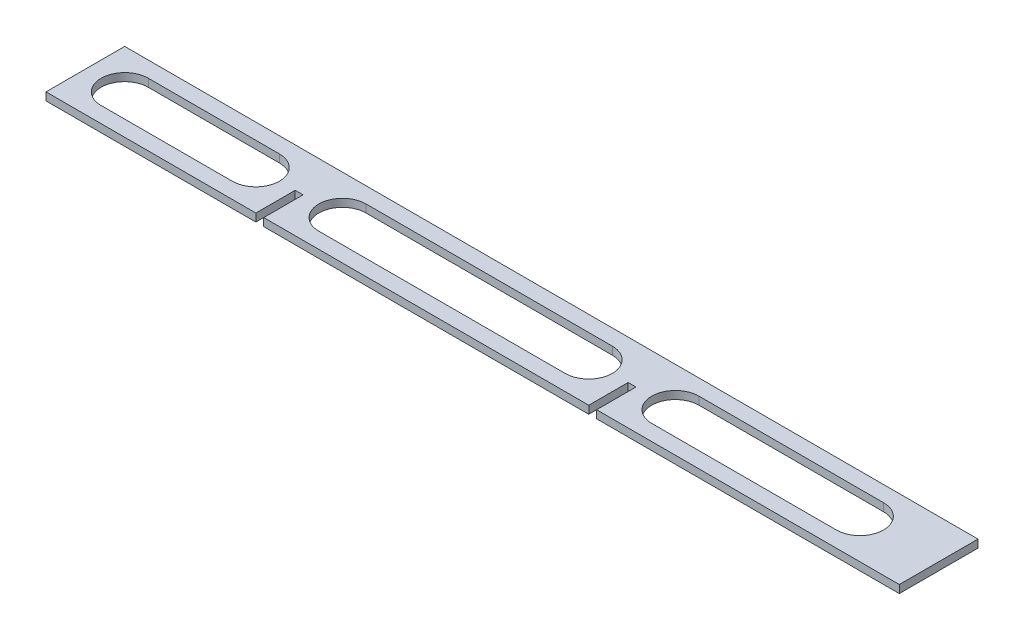
ISO-10303-21;
HEADER;
FILE_DESCRIPTION(('STEP AP214'),'2;1');
FILE_NAME('part.step','',(''),(''),'','','');
FILE_SCHEMA(('AUTOMOTIVE_DESIGN { 1 0 10303 214 1 1 1 1 }'));
ENDSEC;
DATA;
#1=APPLICATION_CONTEXT('core data for automotive mechanical design processes');
#2=APPLICATION_PROTOCOL_DEFINITION('international standard','automotive_design',2000,#1);
#3=PRODUCT_CONTEXT('',#1,'mechanical');
#4=PRODUCT('Part','Part','',(#3));
#5=PRODUCT_RELATED_PRODUCT_CATEGORY('part','',(#4));
#6=PRODUCT_DEFINITION_FORMATION('','',#4);
#7=PRODUCT_DEFINITION_CONTEXT('part definition',#1,'design');
#8=PRODUCT_DEFINITION('design','',#6,#7);
#9=PRODUCT_DEFINITION_SHAPE('','',#8);
#10=(LENGTH_UNIT() NAMED_UNIT(*) SI_UNIT(.MILLI.,.METRE.));
#11=(NAMED_UNIT(*) PLANE_ANGLE_UNIT() SI_UNIT($,.RADIAN.));
#12=(NAMED_UNIT(*) SI_UNIT($,.STERADIAN.) SOLID_ANGLE_UNIT());
#13=UNCERTAINTY_MEASURE_WITH_UNIT(LENGTH_MEASURE(1.E-05),#10,'distance_accuracy_value','');
#14=(GEOMETRIC_REPRESENTATION_CONTEXT(3) GLOBAL_UNCERTAINTY_ASSIGNED_CONTEXT((#13)) GLOBAL_UNIT_ASSIGNED_CONTEXT((#10,
#11,#12)) REPRESENTATION_CONTEXT('',''));
#15=CARTESIAN_POINT('',(0.,0.,0.));
#16=DIRECTION('',(0.,0.,1.));
#17=DIRECTION('',(1.,0.,0.));
#18=AXIS2_PLACEMENT_3D('',#15,#16,#17);
#19=CARTESIAN_POINT('',(0.,3.,15.));
#20=DIRECTION('',(0.,0.,-1.));
#21=DIRECTION('',(-1.,0.,0.));
#22=AXIS2_PLACEMENT_3D('',#19,#20,#21);
#23=PLANE('',#22);
#24=DIRECTION('',(1.,0.,0.));
#25=VECTOR('',#24,1.);
#26=CARTESIAN_POINT('',(0.,0.,15.));
#27=LINE('',#26,#25);
#28=CARTESIAN_POINT('',(0.,0.,15.));
#29=VERTEX_POINT('',#28);
#30=CARTESIAN_POINT('',(80.,0.,15.));
#31=VERTEX_POINT('',#30);
#32=EDGE_CURVE('E373',#29,#31,#27,.T.);
#33=ORIENTED_EDGE('',*,*,#32,.T.);
#34=DIRECTION('',(0.,1.,0.));
#35=VECTOR('',#34,1.);
#36=CARTESIAN_POINT('',(80.,0.,15.));
#37=LINE('',#36,#35);
#38=CARTESIAN_POINT('',(80.,3.,15.));
#39=VERTEX_POINT('',#38);
#40=EDGE_CURVE('E314',#31,#39,#37,.T.);
#41=ORIENTED_EDGE('',*,*,#40,.T.);
#42=DIRECTION('',(1.,0.,0.));
#43=VECTOR('',#42,1.);
#44=CARTESIAN_POINT('',(0.,3.,15.));
#45=LINE('',#44,#43);
#46=CARTESIAN_POINT('',(0.,3.,15.));
#47=VERTEX_POINT('',#46);
#48=EDGE_CURVE('E361',#47,#39,#45,.T.);
#49=ORIENTED_EDGE('',*,*,#48,.F.);
#50=DIRECTION('',(0.,-1.,0.));
#51=VECTOR('',#50,1.);
#52=CARTESIAN_POINT('',(0.,3.,15.));
#53=LINE('',#52,#51);
#54=EDGE_CURVE('E11',#47,#29,#53,.T.);
#55=ORIENTED_EDGE('',*,*,#54,.T.);
#56=EDGE_LOOP('',(#33,#41,#49,#55));
#57=FACE_BOUND('',#56,.T.);
#58=ADVANCED_FACE('F41',(#57),#23,.F.);
#59=CARTESIAN_POINT('',(83.,3.,15.));
#60=VERTEX_POINT('',#59);
#61=CARTESIAN_POINT('',(206.9,3.,15.));
#62=VERTEX_POINT('',#61);
#63=EDGE_CURVE('E365',#60,#62,#45,.T.);
#64=ORIENTED_EDGE('',*,*,#63,.F.);
#65=DIRECTION('',(0.,1.,0.));
#66=VECTOR('',#65,1.);
#67=CARTESIAN_POINT('',(83.,0.,15.));
#68=LINE('',#67,#66);
#69=CARTESIAN_POINT('',(83.,0.,15.));
#70=VERTEX_POINT('',#69);
#71=EDGE_CURVE('E328',#70,#60,#68,.T.);
#72=ORIENTED_EDGE('',*,*,#71,.F.);
#73=CARTESIAN_POINT('',(206.9,0.,15.));
#74=VERTEX_POINT('',#73);
#75=EDGE_CURVE('E377',#70,#74,#27,.T.);
#76=ORIENTED_EDGE('',*,*,#75,.T.);
#77=DIRECTION('',(0.,1.,0.));
#78=VECTOR('',#77,1.);
#79=CARTESIAN_POINT('',(206.9,0.,15.));
#80=LINE('',#79,#78);
#81=EDGE_CURVE('E332',#74,#62,#80,.T.);
#82=ORIENTED_EDGE('',*,*,#81,.T.);
#83=EDGE_LOOP('',(#64,#72,#76,#82));
#84=FACE_BOUND('',#83,.T.);
#85=ADVANCED_FACE('F417',(#84),#23,.F.);
#86=CARTESIAN_POINT('',(0.,3.,-15.));
#87=DIRECTION('',(1.,0.,0.));
#88=DIRECTION('',(0.,0.,-1.));
#89=AXIS2_PLACEMENT_3D('',#86,#87,#88);
#90=PLANE('',#89);
#91=DIRECTION('',(0.,0.,1.));
#92=VECTOR('',#91,1.);
#93=CARTESIAN_POINT('',(0.,0.,-15.));
#94=LINE('',#93,#92);
#95=CARTESIAN_POINT('',(0.,0.,-15.));
#96=VERTEX_POINT('',#95);
#97=EDGE_CURVE('E325',#96,#29,#94,.T.);
#98=ORIENTED_EDGE('',*,*,#97,.T.);
#99=ORIENTED_EDGE('',*,*,#54,.F.);
#100=DIRECTION('',(0.,0.,1.));
#101=VECTOR('',#100,1.);
#102=CARTESIAN_POINT('',(0.,3.,-15.));
#103=LINE('',#102,#101);
#104=CARTESIAN_POINT('',(0.,3.,-15.));
#105=VERTEX_POINT('',#104);
#106=EDGE_CURVE('E356',#105,#47,#103,.T.);
#107=ORIENTED_EDGE('',*,*,#106,.F.);
#108=DIRECTION('',(0.,-1.,0.));
#109=VECTOR('',#108,1.);
#110=CARTESIAN_POINT('',(0.,3.,-15.));
#111=LINE('',#110,#109);
#112=EDGE_CURVE('E369',#105,#96,#111,.T.);
#113=ORIENTED_EDGE('',*,*,#112,.T.);
#114=EDGE_LOOP('',(#98,#99,#107,#113));
#115=FACE_BOUND('',#114,.T.);
#116=ADVANCED_FACE('F43',(#115),#90,.F.);
#117=CARTESIAN_POINT('',(209.9,3.,15.));
#118=VERTEX_POINT('',#117);
#119=CARTESIAN_POINT('',(325.28,3.,15.));
#120=VERTEX_POINT('',#119);
#121=EDGE_CURVE('E359',#118,#120,#45,.T.);
#122=ORIENTED_EDGE('',*,*,#121,.F.);
#123=DIRECTION('',(0.,1.,0.));
#124=VECTOR('',#123,1.);
#125=CARTESIAN_POINT('',(209.9,0.,15.));
#126=LINE('',#125,#124);
#127=CARTESIAN_POINT('',(209.9,0.,15.));
#128=VERTEX_POINT('',#127);
#129=EDGE_CURVE('E336',#128,#118,#126,.T.);
#130=ORIENTED_EDGE('',*,*,#129,.F.);
#131=CARTESIAN_POINT('',(325.28,0.,15.));
#132=VERTEX_POINT('',#131);
#133=EDGE_CURVE('E372',#128,#132,#27,.T.);
#134=ORIENTED_EDGE('',*,*,#133,.T.);
#135=DIRECTION('',(0.,-1.,0.));
#136=VECTOR('',#135,1.);
#137=CARTESIAN_POINT('',(325.28,3.,15.));
#138=LINE('',#137,#136);
#139=EDGE_CURVE('E49',#120,#132,#138,.T.);
#140=ORIENTED_EDGE('',*,*,#139,.F.);
#141=EDGE_LOOP('',(#122,#130,#134,#140));
#142=FACE_BOUND('',#141,.T.);
#143=ADVANCED_FACE('F428',(#142),#23,.F.);
#144=CARTESIAN_POINT('',(325.28,3.,-15.));
#145=DIRECTION('',(-1.,0.,0.));
#146=DIRECTION('',(0.,0.,1.));
#147=AXIS2_PLACEMENT_3D('',#144,#145,#146);
#148=PLANE('',#147);
#149=DIRECTION('',(0.,0.,-1.));
#150=VECTOR('',#149,1.);
#151=CARTESIAN_POINT('',(325.28,0.,-15.));
#152=LINE('',#151,#150);
#153=CARTESIAN_POINT('',(325.28,0.,-15.));
#154=VERTEX_POINT('',#153);
#155=EDGE_CURVE('E376',#132,#154,#152,.T.);
#156=ORIENTED_EDGE('',*,*,#155,.T.);
#157=DIRECTION('',(0.,-1.,0.));
#158=VECTOR('',#157,1.);
#159=CARTESIAN_POINT('',(325.28,3.,-15.));
#160=LINE('',#159,#158);
#161=CARTESIAN_POINT('',(325.28,3.,-15.));
#162=VERTEX_POINT('',#161);
#163=EDGE_CURVE('E382',#162,#154,#160,.T.);
#164=ORIENTED_EDGE('',*,*,#163,.F.);
#165=DIRECTION('',(0.,0.,-1.));
#166=VECTOR('',#165,1.);
#167=CARTESIAN_POINT('',(325.28,3.,-15.));
#168=LINE('',#167,#166);
#169=EDGE_CURVE('E364',#120,#162,#168,.T.);
#170=ORIENTED_EDGE('',*,*,#169,.F.);
#171=ORIENTED_EDGE('',*,*,#139,.T.);
#172=EDGE_LOOP('',(#156,#164,#170,#171));
#173=FACE_BOUND('',#172,.T.);
#174=ADVANCED_FACE('F389',(#173),#148,.F.);
#175=CARTESIAN_POINT('',(0.,3.,-15.));
#176=DIRECTION('',(0.,0.,1.));
#177=DIRECTION('',(1.,0.,0.));
#178=AXIS2_PLACEMENT_3D('',#175,#176,#177);
#179=PLANE('',#178);
#180=DIRECTION('',(-1.,0.,0.));
#181=VECTOR('',#180,1.);
#182=CARTESIAN_POINT('',(0.,0.,-15.));
#183=LINE('',#182,#181);
#184=EDGE_CURVE('E360',#154,#96,#183,.T.);
#185=ORIENTED_EDGE('',*,*,#184,.T.);
#186=ORIENTED_EDGE('',*,*,#112,.F.);
#187=DIRECTION('',(-1.,0.,0.));
#188=VECTOR('',#187,1.);
#189=CARTESIAN_POINT('',(0.,3.,-15.));
#190=LINE('',#189,#188);
#191=EDGE_CURVE('E367',#162,#105,#190,.T.);
#192=ORIENTED_EDGE('',*,*,#191,.F.);
#193=ORIENTED_EDGE('',*,*,#163,.T.);
#194=EDGE_LOOP('',(#185,#186,#192,#193));
#195=FACE_BOUND('',#194,.T.);
#196=ADVANCED_FACE('F399',(#195),#179,.F.);
#197=CARTESIAN_POINT('',(0.,3.,0.));
#198=DIRECTION('',(0.,1.,0.));
#199=DIRECTION('',(0.,0.,1.));
#200=AXIS2_PLACEMENT_3D('',#197,#198,#199);
#201=PLANE('',#200);
#202=CARTESIAN_POINT('',(15.,3.,0.));
#203=DIRECTION('',(0.,1.,0.));
#204=DIRECTION('',(0.,0.,1.));
#205=AXIS2_PLACEMENT_3D('',#202,#203,#204);
#206=CIRCLE('',#205,9.);
#207=CARTESIAN_POINT('',(15.,3.,-9.));
#208=VERTEX_POINT('',#207);
#209=CARTESIAN_POINT('',(15.,3.,9.));
#210=VERTEX_POINT('',#209);
#211=EDGE_CURVE('E56',#208,#210,#206,.T.);
#212=ORIENTED_EDGE('',*,*,#211,.F.);
#213=DIRECTION('',(-1.,0.,0.));
#214=VECTOR('',#213,1.);
#215=CARTESIAN_POINT('',(15.,3.,-9.));
#216=LINE('',#215,#214);
#217=CARTESIAN_POINT('',(65.,3.,-9.));
#218=VERTEX_POINT('',#217);
#219=EDGE_CURVE('E223',#218,#208,#216,.T.);
#220=ORIENTED_EDGE('',*,*,#219,.F.);
#221=CARTESIAN_POINT('',(65.,3.,0.));
#222=DIRECTION('',(0.,1.,0.));
#223=DIRECTION('',(0.,0.,1.));
#224=AXIS2_PLACEMENT_3D('',#221,#222,#223);
#225=CIRCLE('',#224,9.);
#226=CARTESIAN_POINT('',(65.,3.,9.));
#227=VERTEX_POINT('',#226);
#228=EDGE_CURVE('E226',#227,#218,#225,.T.);
#229=ORIENTED_EDGE('',*,*,#228,.F.);
#230=DIRECTION('',(1.,0.,0.));
#231=VECTOR('',#230,1.);
#232=CARTESIAN_POINT('',(15.,3.,9.));
#233=LINE('',#232,#231);
#234=EDGE_CURVE('E232',#210,#227,#233,.T.);
#235=ORIENTED_EDGE('',*,*,#234,.F.);
#236=EDGE_LOOP('',(#212,#220,#229,#235));
#237=FACE_BOUND('',#236,.T.);
#238=CARTESIAN_POINT('',(98.,3.,0.));
#239=DIRECTION('',(0.,1.,0.));
#240=DIRECTION('',(0.,0.,1.));
#241=AXIS2_PLACEMENT_3D('',#238,#239,#240);
#242=CIRCLE('',#241,9.00000000000001);
#243=CARTESIAN_POINT('',(98.,3.,-9.));
#244=VERTEX_POINT('',#243);
#245=CARTESIAN_POINT('',(98.,3.,9.00000000000003));
#246=VERTEX_POINT('',#245);
#247=EDGE_CURVE('E64',#244,#246,#242,.T.);
#248=ORIENTED_EDGE('',*,*,#247,.F.);
#249=DIRECTION('',(-1.,0.,0.));
#250=VECTOR('',#249,1.);
#251=CARTESIAN_POINT('',(98.,3.,-9.));
#252=LINE('',#251,#250);
#253=CARTESIAN_POINT('',(191.9,3.,-9.));
#254=VERTEX_POINT('',#253);
#255=EDGE_CURVE('E252',#254,#244,#252,.T.);
#256=ORIENTED_EDGE('',*,*,#255,.F.);
#257=CARTESIAN_POINT('',(191.9,3.,0.));
#258=DIRECTION('',(0.,1.,0.));
#259=DIRECTION('',(0.,0.,1.));
#260=AXIS2_PLACEMENT_3D('',#257,#258,#259);
#261=CIRCLE('',#260,9.00000000000001);
#262=CARTESIAN_POINT('',(191.9,3.,9.00000000000001));
#263=VERTEX_POINT('',#262);
#264=EDGE_CURVE('E255',#263,#254,#261,.T.);
#265=ORIENTED_EDGE('',*,*,#264,.F.);
#266=DIRECTION('',(1.,0.,0.));
#267=VECTOR('',#266,1.);
#268=CARTESIAN_POINT('',(98.,3.,9.00000000000003));
#269=LINE('',#268,#267);
#270=EDGE_CURVE('E259',#246,#263,#269,.T.);
#271=ORIENTED_EDGE('',*,*,#270,.F.);
#272=EDGE_LOOP('',(#248,#256,#265,#271));
#273=FACE_BOUND('',#272,.T.);
#274=CARTESIAN_POINT('',(224.9,3.,0.));
#275=DIRECTION('',(0.,1.,0.));
#276=DIRECTION('',(0.,0.,1.));
#277=AXIS2_PLACEMENT_3D('',#274,#275,#276);
#278=CIRCLE('',#277,9.00000000000001);
#279=CARTESIAN_POINT('',(224.9,3.,-9.));
#280=VERTEX_POINT('',#279);
#281=CARTESIAN_POINT('',(224.9,3.,9.00000000000002));
#282=VERTEX_POINT('',#281);
#283=EDGE_CURVE('E251',#280,#282,#278,.T.);
#284=ORIENTED_EDGE('',*,*,#283,.F.);
#285=DIRECTION('',(-1.,0.,0.));
#286=VECTOR('',#285,1.);
#287=CARTESIAN_POINT('',(224.9,3.,-9.));
#288=LINE('',#287,#286);
#289=CARTESIAN_POINT('',(295.28,3.,-9.));
#290=VERTEX_POINT('',#289);
#291=EDGE_CURVE('E283',#290,#280,#288,.T.);
#292=ORIENTED_EDGE('',*,*,#291,.F.);
#293=CARTESIAN_POINT('',(295.28,3.,0.));
#294=DIRECTION('',(0.,1.,0.));
#295=DIRECTION('',(0.,0.,1.));
#296=AXIS2_PLACEMENT_3D('',#293,#294,#295);
#297=CIRCLE('',#296,9.00000000000001);
#298=CARTESIAN_POINT('',(295.28,3.,9.00000000000002));
#299=VERTEX_POINT('',#298);
#300=EDGE_CURVE('E286',#299,#290,#297,.T.);
#301=ORIENTED_EDGE('',*,*,#300,.F.);
#302=DIRECTION('',(1.,0.,0.));
#303=VECTOR('',#302,1.);
#304=CARTESIAN_POINT('',(224.9,3.,9.00000000000002));
#305=LINE('',#304,#303);
#306=EDGE_CURVE('E290',#282,#299,#305,.T.);
#307=ORIENTED_EDGE('',*,*,#306,.F.);
#308=EDGE_LOOP('',(#284,#292,#301,#307));
#309=FACE_BOUND('',#308,.T.);
#310=DIRECTION('',(0.,0.,1.));
#311=VECTOR('',#310,1.);
#312=CARTESIAN_POINT('',(80.,3.,15.));
#313=LINE('',#312,#311);
#314=CARTESIAN_POINT('',(80.,3.,0.));
#315=VERTEX_POINT('',#314);
#316=EDGE_CURVE('E315',#315,#39,#313,.T.);
#317=ORIENTED_EDGE('',*,*,#316,.F.);
#318=DIRECTION('',(-1.,0.,0.));
#319=VECTOR('',#318,1.);
#320=CARTESIAN_POINT('',(80.,3.,0.));
#321=LINE('',#320,#319);
#322=CARTESIAN_POINT('',(83.,3.,0.));
#323=VERTEX_POINT('',#322);
#324=EDGE_CURVE('E308',#323,#315,#321,.T.);
#325=ORIENTED_EDGE('',*,*,#324,.F.);
#326=DIRECTION('',(0.,0.,-1.));
#327=VECTOR('',#326,1.);
#328=CARTESIAN_POINT('',(83.,3.,15.));
#329=LINE('',#328,#327);
#330=EDGE_CURVE('E317',#60,#323,#329,.T.);
#331=ORIENTED_EDGE('',*,*,#330,.F.);
#332=ORIENTED_EDGE('',*,*,#63,.T.);
#333=DIRECTION('',(0.,0.,1.));
#334=VECTOR('',#333,1.);
#335=CARTESIAN_POINT('',(206.9,3.,15.));
#336=LINE('',#335,#334);
#337=CARTESIAN_POINT('',(206.9,3.,0.));
#338=VERTEX_POINT('',#337);
#339=EDGE_CURVE('E318',#338,#62,#336,.T.);
#340=ORIENTED_EDGE('',*,*,#339,.F.);
#341=DIRECTION('',(-1.,0.,0.));
#342=VECTOR('',#341,1.);
#343=CARTESIAN_POINT('',(206.9,3.,0.));
#344=LINE('',#343,#342);
#345=CARTESIAN_POINT('',(209.9,3.,0.));
#346=VERTEX_POINT('',#345);
#347=EDGE_CURVE('E341',#346,#338,#344,.T.);
#348=ORIENTED_EDGE('',*,*,#347,.F.);
#349=DIRECTION('',(0.,0.,-1.));
#350=VECTOR('',#349,1.);
#351=CARTESIAN_POINT('',(209.9,3.,15.));
#352=LINE('',#351,#350);
#353=EDGE_CURVE('E344',#118,#346,#352,.T.);
#354=ORIENTED_EDGE('',*,*,#353,.F.);
#355=ORIENTED_EDGE('',*,*,#121,.T.);
#356=ORIENTED_EDGE('',*,*,#169,.T.);
#357=ORIENTED_EDGE('',*,*,#191,.T.);
#358=ORIENTED_EDGE('',*,*,#106,.T.);
#359=ORIENTED_EDGE('',*,*,#48,.T.);
#360=EDGE_LOOP('',(#317,#325,#331,#332,#340,#348,#354,#355,#356,#357,#358,#359));
#361=FACE_BOUND('',#360,.T.);
#362=ADVANCED_FACE('F406',(#237,#273,#309,#361),#201,.T.);
#363=CARTESIAN_POINT('',(0.,0.,0.));
#364=DIRECTION('',(0.,1.,0.));
#365=DIRECTION('',(0.,0.,1.));
#366=AXIS2_PLACEMENT_3D('',#363,#364,#365);
#367=PLANE('',#366);
#368=DIRECTION('',(-1.,0.,0.));
#369=VECTOR('',#368,1.);
#370=CARTESIAN_POINT('',(15.,0.,-9.));
#371=LINE('',#370,#369);
#372=CARTESIAN_POINT('',(65.,0.,-9.));
#373=VERTEX_POINT('',#372);
#374=CARTESIAN_POINT('',(15.,0.,-9.));
#375=VERTEX_POINT('',#374);
#376=EDGE_CURVE('E210',#373,#375,#371,.T.);
#377=ORIENTED_EDGE('',*,*,#376,.T.);
#378=CARTESIAN_POINT('',(15.,0.,0.));
#379=DIRECTION('',(0.,1.,0.));
#380=DIRECTION('',(0.,0.,1.));
#381=AXIS2_PLACEMENT_3D('',#378,#379,#380);
#382=CIRCLE('',#381,9.);
#383=CARTESIAN_POINT('',(15.,0.,9.));
#384=VERTEX_POINT('',#383);
#385=EDGE_CURVE('E204',#375,#384,#382,.T.);
#386=ORIENTED_EDGE('',*,*,#385,.T.);
#387=DIRECTION('',(1.,0.,0.));
#388=VECTOR('',#387,1.);
#389=CARTESIAN_POINT('',(15.,0.,9.));
#390=LINE('',#389,#388);
#391=CARTESIAN_POINT('',(65.,0.,9.));
#392=VERTEX_POINT('',#391);
#393=EDGE_CURVE('E214',#384,#392,#390,.T.);
#394=ORIENTED_EDGE('',*,*,#393,.T.);
#395=CARTESIAN_POINT('',(65.,0.,0.));
#396=DIRECTION('',(0.,1.,0.));
#397=DIRECTION('',(0.,0.,1.));
#398=AXIS2_PLACEMENT_3D('',#395,#396,#397);
#399=CIRCLE('',#398,9.);
#400=EDGE_CURVE('E218',#392,#373,#399,.T.);
#401=ORIENTED_EDGE('',*,*,#400,.T.);
#402=EDGE_LOOP('',(#377,#386,#394,#401));
#403=FACE_BOUND('',#402,.T.);
#404=DIRECTION('',(-1.,0.,0.));
#405=VECTOR('',#404,1.);
#406=CARTESIAN_POINT('',(98.,0.,-9.));
#407=LINE('',#406,#405);
#408=CARTESIAN_POINT('',(191.9,0.,-9.));
#409=VERTEX_POINT('',#408);
#410=CARTESIAN_POINT('',(98.,0.,-9.));
#411=VERTEX_POINT('',#410);
#412=EDGE_CURVE('E244',#409,#411,#407,.T.);
#413=ORIENTED_EDGE('',*,*,#412,.T.);
#414=CARTESIAN_POINT('',(98.,0.,0.));
#415=DIRECTION('',(0.,1.,0.));
#416=DIRECTION('',(0.,0.,1.));
#417=AXIS2_PLACEMENT_3D('',#414,#415,#416);
#418=CIRCLE('',#417,9.00000000000001);
#419=CARTESIAN_POINT('',(98.,0.,9.00000000000003));
#420=VERTEX_POINT('',#419);
#421=EDGE_CURVE('E256',#411,#420,#418,.T.);
#422=ORIENTED_EDGE('',*,*,#421,.T.);
#423=DIRECTION('',(1.,0.,0.));
#424=VECTOR('',#423,1.);
#425=CARTESIAN_POINT('',(98.,0.,9.00000000000003));
#426=LINE('',#425,#424);
#427=CARTESIAN_POINT('',(191.9,0.,9.00000000000002));
#428=VERTEX_POINT('',#427);
#429=EDGE_CURVE('E268',#420,#428,#426,.T.);
#430=ORIENTED_EDGE('',*,*,#429,.T.);
#431=CARTESIAN_POINT('',(191.9,0.,0.));
#432=DIRECTION('',(0.,1.,0.));
#433=DIRECTION('',(0.,0.,1.));
#434=AXIS2_PLACEMENT_3D('',#431,#432,#433);
#435=CIRCLE('',#434,9.00000000000001);
#436=EDGE_CURVE('E265',#428,#409,#435,.T.);
#437=ORIENTED_EDGE('',*,*,#436,.T.);
#438=EDGE_LOOP('',(#413,#422,#430,#437));
#439=FACE_BOUND('',#438,.T.);
#440=DIRECTION('',(-1.,0.,0.));
#441=VECTOR('',#440,1.);
#442=CARTESIAN_POINT('',(224.9,0.,-9.));
#443=LINE('',#442,#441);
#444=CARTESIAN_POINT('',(295.28,0.,-9.));
#445=VERTEX_POINT('',#444);
#446=CARTESIAN_POINT('',(224.9,0.,-9.));
#447=VERTEX_POINT('',#446);
#448=EDGE_CURVE('E276',#445,#447,#443,.T.);
#449=ORIENTED_EDGE('',*,*,#448,.T.);
#450=CARTESIAN_POINT('',(224.9,0.,0.));
#451=DIRECTION('',(0.,1.,0.));
#452=DIRECTION('',(0.,0.,1.));
#453=AXIS2_PLACEMENT_3D('',#450,#451,#452);
#454=CIRCLE('',#453,9.00000000000001);
#455=CARTESIAN_POINT('',(224.9,0.,9.00000000000002));
#456=VERTEX_POINT('',#455);
#457=EDGE_CURVE('E287',#447,#456,#454,.T.);
#458=ORIENTED_EDGE('',*,*,#457,.T.);
#459=DIRECTION('',(1.,0.,0.));
#460=VECTOR('',#459,1.);
#461=CARTESIAN_POINT('',(224.9,0.,9.00000000000002));
#462=LINE('',#461,#460);
#463=CARTESIAN_POINT('',(295.28,0.,9.00000000000002));
#464=VERTEX_POINT('',#463);
#465=EDGE_CURVE('E299',#456,#464,#462,.T.);
#466=ORIENTED_EDGE('',*,*,#465,.T.);
#467=CARTESIAN_POINT('',(295.28,0.,0.));
#468=DIRECTION('',(0.,1.,0.));
#469=DIRECTION('',(0.,0.,1.));
#470=AXIS2_PLACEMENT_3D('',#467,#468,#469);
#471=CIRCLE('',#470,9.00000000000001);
#472=EDGE_CURVE('E296',#464,#445,#471,.T.);
#473=ORIENTED_EDGE('',*,*,#472,.T.);
#474=EDGE_LOOP('',(#449,#458,#466,#473));
#475=FACE_BOUND('',#474,.T.);
#476=DIRECTION('',(-1.,0.,0.));
#477=VECTOR('',#476,1.);
#478=CARTESIAN_POINT('',(80.,0.,0.));
#479=LINE('',#478,#477);
#480=CARTESIAN_POINT('',(83.,0.,0.));
#481=VERTEX_POINT('',#480);
#482=CARTESIAN_POINT('',(80.,0.,0.));
#483=VERTEX_POINT('',#482);
#484=EDGE_CURVE('E311',#481,#483,#479,.T.);
#485=ORIENTED_EDGE('',*,*,#484,.T.);
#486=DIRECTION('',(0.,0.,1.));
#487=VECTOR('',#486,1.);
#488=CARTESIAN_POINT('',(80.,0.,15.));
#489=LINE('',#488,#487);
#490=EDGE_CURVE('E304',#483,#31,#489,.T.);
#491=ORIENTED_EDGE('',*,*,#490,.T.);
#492=ORIENTED_EDGE('',*,*,#32,.F.);
#493=ORIENTED_EDGE('',*,*,#97,.F.);
#494=ORIENTED_EDGE('',*,*,#184,.F.);
#495=ORIENTED_EDGE('',*,*,#155,.F.);
#496=ORIENTED_EDGE('',*,*,#133,.F.);
#497=DIRECTION('',(0.,0.,-1.));
#498=VECTOR('',#497,1.);
#499=CARTESIAN_POINT('',(209.9,0.,15.));
#500=LINE('',#499,#498);
#501=CARTESIAN_POINT('',(209.9,0.,0.));
#502=VERTEX_POINT('',#501);
#503=EDGE_CURVE('E351',#128,#502,#500,.T.);
#504=ORIENTED_EDGE('',*,*,#503,.T.);
#505=DIRECTION('',(-1.,0.,0.));
#506=VECTOR('',#505,1.);
#507=CARTESIAN_POINT('',(206.9,0.,0.));
#508=LINE('',#507,#506);
#509=CARTESIAN_POINT('',(206.9,0.,0.));
#510=VERTEX_POINT('',#509);
#511=EDGE_CURVE('E335',#502,#510,#508,.T.);
#512=ORIENTED_EDGE('',*,*,#511,.T.);
#513=DIRECTION('',(0.,0.,1.));
#514=VECTOR('',#513,1.);
#515=CARTESIAN_POINT('',(206.9,0.,15.));
#516=LINE('',#515,#514);
#517=EDGE_CURVE('E345',#510,#74,#516,.T.);
#518=ORIENTED_EDGE('',*,*,#517,.T.);
#519=ORIENTED_EDGE('',*,*,#75,.F.);
#520=DIRECTION('',(0.,0.,-1.));
#521=VECTOR('',#520,1.);
#522=CARTESIAN_POINT('',(83.,0.,15.));
#523=LINE('',#522,#521);
#524=EDGE_CURVE('E307',#70,#481,#523,.T.);
#525=ORIENTED_EDGE('',*,*,#524,.T.);
#526=EDGE_LOOP('',(#485,#491,#492,#493,#494,#495,#496,#504,#512,#518,#519,#525));
#527=FACE_BOUND('',#526,.T.);
#528=ADVANCED_FACE('F220',(#403,#439,#475,#527),#367,.F.);
#529=CARTESIAN_POINT('',(206.9,0.,15.));
#530=DIRECTION('',(-1.,0.,0.));
#531=DIRECTION('',(0.,0.,1.));
#532=AXIS2_PLACEMENT_3D('',#529,#530,#531);
#533=PLANE('',#532);
#534=ORIENTED_EDGE('',*,*,#339,.T.);
#535=ORIENTED_EDGE('',*,*,#81,.F.);
#536=ORIENTED_EDGE('',*,*,#517,.F.);
#537=DIRECTION('',(0.,1.,0.));
#538=VECTOR('',#537,1.);
#539=CARTESIAN_POINT('',(206.9,0.,0.));
#540=LINE('',#539,#538);
#541=EDGE_CURVE('E238',#510,#338,#540,.T.);
#542=ORIENTED_EDGE('',*,*,#541,.T.);
#543=EDGE_LOOP('',(#534,#535,#536,#542));
#544=FACE_BOUND('',#543,.T.);
#545=ADVANCED_FACE('F422',(#544),#533,.F.);
#546=CARTESIAN_POINT('',(206.9,0.,0.));
#547=DIRECTION('',(0.,0.,-1.));
#548=DIRECTION('',(-1.,0.,0.));
#549=AXIS2_PLACEMENT_3D('',#546,#547,#548);
#550=PLANE('',#549);
#551=ORIENTED_EDGE('',*,*,#347,.T.);
#552=ORIENTED_EDGE('',*,*,#541,.F.);
#553=ORIENTED_EDGE('',*,*,#511,.F.);
#554=DIRECTION('',(0.,1.,0.));
#555=VECTOR('',#554,1.);
#556=CARTESIAN_POINT('',(209.9,0.,0.));
#557=LINE('',#556,#555);
#558=EDGE_CURVE('E338',#502,#346,#557,.T.);
#559=ORIENTED_EDGE('',*,*,#558,.T.);
#560=EDGE_LOOP('',(#551,#552,#553,#559));
#561=FACE_BOUND('',#560,.T.);
#562=ADVANCED_FACE('F425',(#561),#550,.F.);
#563=CARTESIAN_POINT('',(209.9,0.,15.));
#564=DIRECTION('',(1.,0.,0.));
#565=DIRECTION('',(0.,0.,-1.));
#566=AXIS2_PLACEMENT_3D('',#563,#564,#565);
#567=PLANE('',#566);
#568=ORIENTED_EDGE('',*,*,#353,.T.);
#569=ORIENTED_EDGE('',*,*,#558,.F.);
#570=ORIENTED_EDGE('',*,*,#503,.F.);
#571=ORIENTED_EDGE('',*,*,#129,.T.);
#572=EDGE_LOOP('',(#568,#569,#570,#571));
#573=FACE_BOUND('',#572,.T.);
#574=ADVANCED_FACE('F427',(#573),#567,.F.);
#575=CARTESIAN_POINT('',(80.,0.,15.));
#576=DIRECTION('',(-1.,0.,0.));
#577=DIRECTION('',(0.,0.,1.));
#578=AXIS2_PLACEMENT_3D('',#575,#576,#577);
#579=PLANE('',#578);
#580=ORIENTED_EDGE('',*,*,#316,.T.);
#581=ORIENTED_EDGE('',*,*,#40,.F.);
#582=ORIENTED_EDGE('',*,*,#490,.F.);
#583=DIRECTION('',(0.,1.,0.));
#584=VECTOR('',#583,1.);
#585=CARTESIAN_POINT('',(80.,0.,0.));
#586=LINE('',#585,#584);
#587=EDGE_CURVE('E323',#483,#315,#586,.T.);
#588=ORIENTED_EDGE('',*,*,#587,.T.);
#589=EDGE_LOOP('',(#580,#581,#582,#588));
#590=FACE_BOUND('',#589,.T.);
#591=ADVANCED_FACE('F505',(#590),#579,.F.);
#592=CARTESIAN_POINT('',(80.,0.,0.));
#593=DIRECTION('',(0.,0.,-1.));
#594=DIRECTION('',(-1.,0.,0.));
#595=AXIS2_PLACEMENT_3D('',#592,#593,#594);
#596=PLANE('',#595);
#597=ORIENTED_EDGE('',*,*,#324,.T.);
#598=ORIENTED_EDGE('',*,*,#587,.F.);
#599=ORIENTED_EDGE('',*,*,#484,.F.);
#600=DIRECTION('',(0.,1.,0.));
#601=VECTOR('',#600,1.);
#602=CARTESIAN_POINT('',(83.,0.,0.));
#603=LINE('',#602,#601);
#604=EDGE_CURVE('E326',#481,#323,#603,.T.);
#605=ORIENTED_EDGE('',*,*,#604,.T.);
#606=EDGE_LOOP('',(#597,#598,#599,#605));
#607=FACE_BOUND('',#606,.T.);
#608=ADVANCED_FACE('F515',(#607),#596,.F.);
#609=CARTESIAN_POINT('',(83.,0.,15.));
#610=DIRECTION('',(1.,0.,0.));
#611=DIRECTION('',(0.,0.,-1.));
#612=AXIS2_PLACEMENT_3D('',#609,#610,#611);
#613=PLANE('',#612);
#614=ORIENTED_EDGE('',*,*,#330,.T.);
#615=ORIENTED_EDGE('',*,*,#604,.F.);
#616=ORIENTED_EDGE('',*,*,#524,.F.);
#617=ORIENTED_EDGE('',*,*,#71,.T.);
#618=EDGE_LOOP('',(#614,#615,#616,#617));
#619=FACE_BOUND('',#618,.T.);
#620=ADVANCED_FACE('F526',(#619),#613,.F.);
#621=CARTESIAN_POINT('',(224.9,0.,0.));
#622=DIRECTION('',(0.,1.,0.));
#623=DIRECTION('',(0.,0.,1.));
#624=AXIS2_PLACEMENT_3D('',#621,#622,#623);
#625=CYLINDRICAL_SURFACE('',#624,9.00000000000001);
#626=ORIENTED_EDGE('',*,*,#283,.T.);
#627=DIRECTION('',(0.,1.,0.));
#628=VECTOR('',#627,1.);
#629=CARTESIAN_POINT('',(224.9,0.,9.00000000000002));
#630=LINE('',#629,#628);
#631=EDGE_CURVE('E273',#456,#282,#630,.T.);
#632=ORIENTED_EDGE('',*,*,#631,.F.);
#633=ORIENTED_EDGE('',*,*,#457,.F.);
#634=DIRECTION('',(0.,1.,0.));
#635=VECTOR('',#634,1.);
#636=CARTESIAN_POINT('',(224.9,0.,-9.));
#637=LINE('',#636,#635);
#638=EDGE_CURVE('E281',#447,#280,#637,.T.);
#639=ORIENTED_EDGE('',*,*,#638,.T.);
#640=EDGE_LOOP('',(#626,#632,#633,#639));
#641=FACE_BOUND('',#640,.T.);
#642=ADVANCED_FACE('F537',(#641),#625,.F.);
#643=CARTESIAN_POINT('',(224.9,0.,-9.));
#644=DIRECTION('',(0.,0.,-1.));
#645=DIRECTION('',(-1.,0.,0.));
#646=AXIS2_PLACEMENT_3D('',#643,#644,#645);
#647=PLANE('',#646);
#648=ORIENTED_EDGE('',*,*,#291,.T.);
#649=ORIENTED_EDGE('',*,*,#638,.F.);
#650=ORIENTED_EDGE('',*,*,#448,.F.);
#651=DIRECTION('',(0.,1.,0.));
#652=VECTOR('',#651,1.);
#653=CARTESIAN_POINT('',(295.28,0.,-9.));
#654=LINE('',#653,#652);
#655=EDGE_CURVE('E279',#445,#290,#654,.T.);
#656=ORIENTED_EDGE('',*,*,#655,.T.);
#657=EDGE_LOOP('',(#648,#649,#650,#656));
#658=FACE_BOUND('',#657,.T.);
#659=ADVANCED_FACE('F549',(#658),#647,.F.);
#660=CARTESIAN_POINT('',(295.28,0.,0.));
#661=DIRECTION('',(0.,1.,0.));
#662=DIRECTION('',(0.,0.,1.));
#663=AXIS2_PLACEMENT_3D('',#660,#661,#662);
#664=CYLINDRICAL_SURFACE('',#663,9.00000000000001);
#665=ORIENTED_EDGE('',*,*,#300,.T.);
#666=ORIENTED_EDGE('',*,*,#655,.F.);
#667=ORIENTED_EDGE('',*,*,#472,.F.);
#668=DIRECTION('',(0.,1.,0.));
#669=VECTOR('',#668,1.);
#670=CARTESIAN_POINT('',(295.28,0.,9.00000000000002));
#671=LINE('',#670,#669);
#672=EDGE_CURVE('E277',#464,#299,#671,.T.);
#673=ORIENTED_EDGE('',*,*,#672,.T.);
#674=EDGE_LOOP('',(#665,#666,#667,#673));
#675=FACE_BOUND('',#674,.T.);
#676=ADVANCED_FACE('F561',(#675),#664,.F.);
#677=CARTESIAN_POINT('',(224.9,0.,9.00000000000002));
#678=DIRECTION('',(0.,0.,1.));
#679=DIRECTION('',(1.,0.,0.));
#680=AXIS2_PLACEMENT_3D('',#677,#678,#679);
#681=PLANE('',#680);
#682=ORIENTED_EDGE('',*,*,#306,.T.);
#683=ORIENTED_EDGE('',*,*,#672,.F.);
#684=ORIENTED_EDGE('',*,*,#465,.F.);
#685=ORIENTED_EDGE('',*,*,#631,.T.);
#686=EDGE_LOOP('',(#682,#683,#684,#685));
#687=FACE_BOUND('',#686,.T.);
#688=ADVANCED_FACE('F572',(#687),#681,.F.);
#689=CARTESIAN_POINT('',(98.,0.,0.));
#690=DIRECTION('',(0.,1.,0.));
#691=DIRECTION('',(0.,0.,1.));
#692=AXIS2_PLACEMENT_3D('',#689,#690,#691);
#693=CYLINDRICAL_SURFACE('',#692,9.00000000000001);
#694=ORIENTED_EDGE('',*,*,#247,.T.);
#695=DIRECTION('',(0.,1.,0.));
#696=VECTOR('',#695,1.);
#697=CARTESIAN_POINT('',(98.,0.,9.00000000000003));
#698=LINE('',#697,#696);
#699=EDGE_CURVE('E242',#420,#246,#698,.T.);
#700=ORIENTED_EDGE('',*,*,#699,.F.);
#701=ORIENTED_EDGE('',*,*,#421,.F.);
#702=DIRECTION('',(0.,1.,0.));
#703=VECTOR('',#702,1.);
#704=CARTESIAN_POINT('',(98.,0.,-9.));
#705=LINE('',#704,#703);
#706=EDGE_CURVE('E249',#411,#244,#705,.T.);
#707=ORIENTED_EDGE('',*,*,#706,.T.);
#708=EDGE_LOOP('',(#694,#700,#701,#707));
#709=FACE_BOUND('',#708,.T.);
#710=ADVANCED_FACE('F583',(#709),#693,.F.);
#711=CARTESIAN_POINT('',(98.,0.,-9.));
#712=DIRECTION('',(0.,0.,-1.));
#713=DIRECTION('',(-1.,0.,0.));
#714=AXIS2_PLACEMENT_3D('',#711,#712,#713);
#715=PLANE('',#714);
#716=ORIENTED_EDGE('',*,*,#255,.T.);
#717=ORIENTED_EDGE('',*,*,#706,.F.);
#718=ORIENTED_EDGE('',*,*,#412,.F.);
#719=DIRECTION('',(0.,1.,0.));
#720=VECTOR('',#719,1.);
#721=CARTESIAN_POINT('',(191.9,0.,-9.));
#722=LINE('',#721,#720);
#723=EDGE_CURVE('E247',#409,#254,#722,.T.);
#724=ORIENTED_EDGE('',*,*,#723,.T.);
#725=EDGE_LOOP('',(#716,#717,#718,#724));
#726=FACE_BOUND('',#725,.T.);
#727=ADVANCED_FACE('F594',(#726),#715,.F.);
#728=CARTESIAN_POINT('',(191.9,0.,0.));
#729=DIRECTION('',(0.,1.,0.));
#730=DIRECTION('',(0.,0.,1.));
#731=AXIS2_PLACEMENT_3D('',#728,#729,#730);
#732=CYLINDRICAL_SURFACE('',#731,9.00000000000001);
#733=ORIENTED_EDGE('',*,*,#264,.T.);
#734=ORIENTED_EDGE('',*,*,#723,.F.);
#735=ORIENTED_EDGE('',*,*,#436,.F.);
#736=DIRECTION('',(0.,1.,0.));
#737=VECTOR('',#736,1.);
#738=CARTESIAN_POINT('',(191.9,0.,9.00000000000001));
#739=LINE('',#738,#737);
#740=EDGE_CURVE('E245',#428,#263,#739,.T.);
#741=ORIENTED_EDGE('',*,*,#740,.T.);
#742=EDGE_LOOP('',(#733,#734,#735,#741));
#743=FACE_BOUND('',#742,.T.);
#744=ADVANCED_FACE('F604',(#743),#732,.F.);
#745=CARTESIAN_POINT('',(98.,0.,9.00000000000003));
#746=DIRECTION('',(0.,0.,1.));
#747=DIRECTION('',(1.,0.,0.));
#748=AXIS2_PLACEMENT_3D('',#745,#746,#747);
#749=PLANE('',#748);
#750=ORIENTED_EDGE('',*,*,#270,.T.);
#751=ORIENTED_EDGE('',*,*,#740,.F.);
#752=ORIENTED_EDGE('',*,*,#429,.F.);
#753=ORIENTED_EDGE('',*,*,#699,.T.);
#754=EDGE_LOOP('',(#750,#751,#752,#753));
#755=FACE_BOUND('',#754,.T.);
#756=ADVANCED_FACE('F615',(#755),#749,.F.);
#757=CARTESIAN_POINT('',(15.,0.,0.));
#758=DIRECTION('',(0.,1.,0.));
#759=DIRECTION('',(0.,0.,1.));
#760=AXIS2_PLACEMENT_3D('',#757,#758,#759);
#761=CYLINDRICAL_SURFACE('',#760,9.);
#762=ORIENTED_EDGE('',*,*,#211,.T.);
#763=DIRECTION('',(0.,1.,0.));
#764=VECTOR('',#763,1.);
#765=CARTESIAN_POINT('',(15.,0.,9.));
#766=LINE('',#765,#764);
#767=EDGE_CURVE('E200',#384,#210,#766,.T.);
#768=ORIENTED_EDGE('',*,*,#767,.F.);
#769=ORIENTED_EDGE('',*,*,#385,.F.);
#770=DIRECTION('',(0.,1.,0.));
#771=VECTOR('',#770,1.);
#772=CARTESIAN_POINT('',(15.,0.,-9.));
#773=LINE('',#772,#771);
#774=EDGE_CURVE('E236',#375,#208,#773,.T.);
#775=ORIENTED_EDGE('',*,*,#774,.T.);
#776=EDGE_LOOP('',(#762,#768,#769,#775));
#777=FACE_BOUND('',#776,.T.);
#778=ADVANCED_FACE('F202',(#777),#761,.F.);
#779=CARTESIAN_POINT('',(15.,0.,-9.));
#780=DIRECTION('',(0.,0.,-1.));
#781=DIRECTION('',(-1.,0.,0.));
#782=AXIS2_PLACEMENT_3D('',#779,#780,#781);
#783=PLANE('',#782);
#784=ORIENTED_EDGE('',*,*,#219,.T.);
#785=ORIENTED_EDGE('',*,*,#774,.F.);
#786=ORIENTED_EDGE('',*,*,#376,.F.);
#787=DIRECTION('',(0.,1.,0.));
#788=VECTOR('',#787,1.);
#789=CARTESIAN_POINT('',(65.,0.,-9.));
#790=LINE('',#789,#788);
#791=EDGE_CURVE('E239',#373,#218,#790,.T.);
#792=ORIENTED_EDGE('',*,*,#791,.T.);
#793=EDGE_LOOP('',(#784,#785,#786,#792));
#794=FACE_BOUND('',#793,.T.);
#795=ADVANCED_FACE('F636',(#794),#783,.F.);
#796=CARTESIAN_POINT('',(65.,0.,0.));
#797=DIRECTION('',(0.,1.,0.));
#798=DIRECTION('',(0.,0.,1.));
#799=AXIS2_PLACEMENT_3D('',#796,#797,#798);
#800=CYLINDRICAL_SURFACE('',#799,9.);
#801=ORIENTED_EDGE('',*,*,#228,.T.);
#802=ORIENTED_EDGE('',*,*,#791,.F.);
#803=ORIENTED_EDGE('',*,*,#400,.F.);
#804=DIRECTION('',(0.,1.,0.));
#805=VECTOR('',#804,1.);
#806=CARTESIAN_POINT('',(65.,0.,9.));
#807=LINE('',#806,#805);
#808=EDGE_CURVE('E209',#392,#227,#807,.T.);
#809=ORIENTED_EDGE('',*,*,#808,.T.);
#810=EDGE_LOOP('',(#801,#802,#803,#809));
#811=FACE_BOUND('',#810,.T.);
#812=ADVANCED_FACE('F646',(#811),#800,.F.);
#813=CARTESIAN_POINT('',(15.,0.,9.));
#814=DIRECTION('',(0.,0.,1.));
#815=DIRECTION('',(1.,0.,0.));
#816=AXIS2_PLACEMENT_3D('',#813,#814,#815);
#817=PLANE('',#816);
#818=ORIENTED_EDGE('',*,*,#234,.T.);
#819=ORIENTED_EDGE('',*,*,#808,.F.);
#820=ORIENTED_EDGE('',*,*,#393,.F.);
#821=ORIENTED_EDGE('',*,*,#767,.T.);
#822=EDGE_LOOP('',(#818,#819,#820,#821));
#823=FACE_BOUND('',#822,.T.);
#824=ADVANCED_FACE('F215',(#823),#817,.F.);
#825=CLOSED_SHELL('',(#58,#85,#116,#143,#174,#196,#362,#528,#545,#562,#574,#591,#608,#620,#642,
#659,#676,#688,#710,#727,#744,#756,#778,#795,#812,#824));
#826=MANIFOLD_SOLID_BREP('B2',#825);
#827=ADVANCED_BREP_SHAPE_REPRESENTATION('',(#18,#826),#14);
#828=SHAPE_DEFINITION_REPRESENTATION(#9,#827);
ENDSEC;
END-ISO-10303-21;
